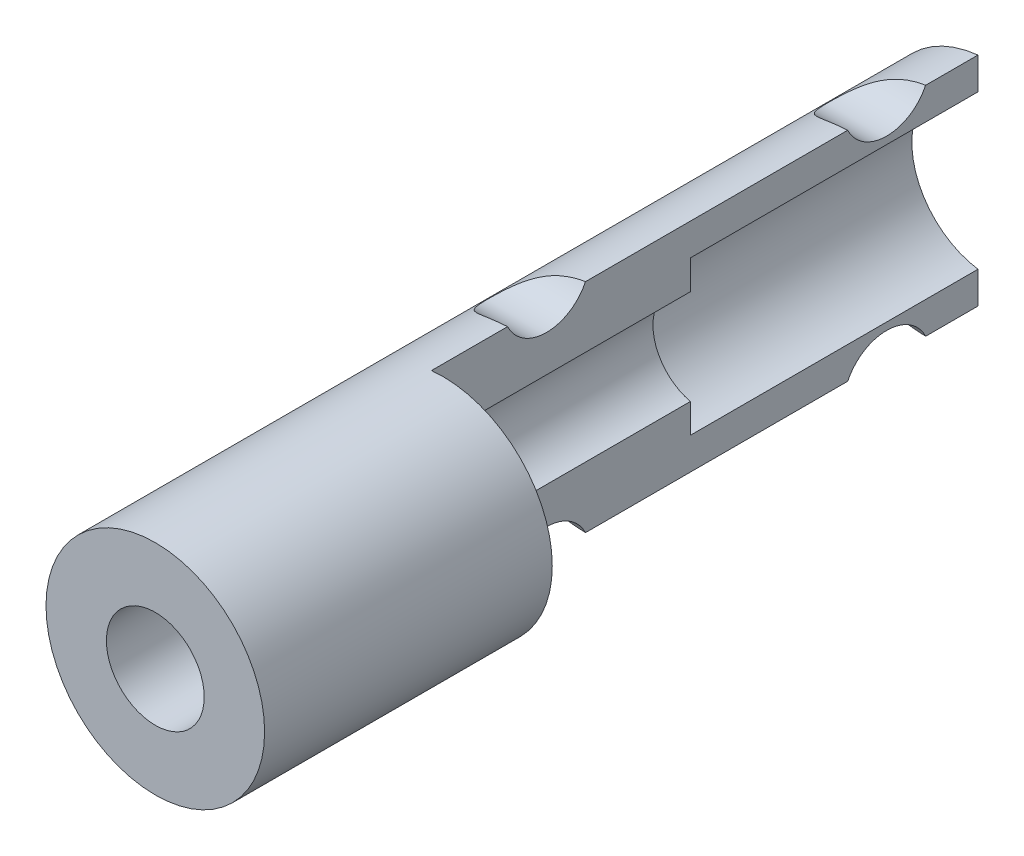
ISO-10303-21;
HEADER;
FILE_DESCRIPTION(('STEP AP214'),'2;1');
FILE_NAME('part.step','',(''),(''),'','','');
FILE_SCHEMA(('AUTOMOTIVE_DESIGN { 1 0 10303 214 1 1 1 1 }'));
ENDSEC;
DATA;
#1=APPLICATION_CONTEXT('core data for automotive mechanical design processes');
#2=APPLICATION_PROTOCOL_DEFINITION('international standard','automotive_design',2000,#1);
#3=PRODUCT_CONTEXT('',#1,'mechanical');
#4=PRODUCT('Part','Part','',(#3));
#5=PRODUCT_RELATED_PRODUCT_CATEGORY('part','',(#4));
#6=PRODUCT_DEFINITION_FORMATION('','',#4);
#7=PRODUCT_DEFINITION_CONTEXT('part definition',#1,'design');
#8=PRODUCT_DEFINITION('design','',#6,#7);
#9=PRODUCT_DEFINITION_SHAPE('','',#8);
#10=(LENGTH_UNIT() NAMED_UNIT(*) SI_UNIT(.MILLI.,.METRE.));
#11=(NAMED_UNIT(*) PLANE_ANGLE_UNIT() SI_UNIT($,.RADIAN.));
#12=(NAMED_UNIT(*) SI_UNIT($,.STERADIAN.) SOLID_ANGLE_UNIT());
#13=UNCERTAINTY_MEASURE_WITH_UNIT(LENGTH_MEASURE(1.E-05),#10,'distance_accuracy_value','');
#14=(GEOMETRIC_REPRESENTATION_CONTEXT(3) GLOBAL_UNCERTAINTY_ASSIGNED_CONTEXT((#13)) GLOBAL_UNIT_ASSIGNED_CONTEXT((#10,
#11,#12)) REPRESENTATION_CONTEXT('',''));
#15=CARTESIAN_POINT('',(0.,0.,0.));
#16=DIRECTION('',(0.,0.,1.));
#17=DIRECTION('',(1.,0.,0.));
#18=AXIS2_PLACEMENT_3D('',#15,#16,#17);
#19=CARTESIAN_POINT('',(0.,0.,-9.));
#20=DIRECTION('',(0.,0.,1.));
#21=DIRECTION('',(1.,0.,0.));
#22=AXIS2_PLACEMENT_3D('',#19,#20,#21);
#23=PLANE('',#22);
#24=CARTESIAN_POINT('',(0.,0.,-9.));
#25=DIRECTION('',(0.,0.,1.));
#26=DIRECTION('',(1.,0.,0.));
#27=AXIS2_PLACEMENT_3D('',#24,#25,#26);
#28=CIRCLE('',#27,2.7);
#29=CARTESIAN_POINT('',(-0.4,2.67020598456374,-9.));
#30=VERTEX_POINT('',#29);
#31=CARTESIAN_POINT('',(-0.4,-2.67020598456374,-9.));
#32=VERTEX_POINT('',#31);
#33=EDGE_CURVE('E35',#30,#32,#28,.T.);
#34=ORIENTED_EDGE('',*,*,#33,.F.);
#35=DIRECTION('',(0.,-1.,0.));
#36=VECTOR('',#35,1.);
#37=CARTESIAN_POINT('',(-0.4,0.,-9.));
#38=LINE('',#37,#36);
#39=CARTESIAN_POINT('',(-0.4,1.65227116418583,-9.));
#40=VERTEX_POINT('',#39);
#41=EDGE_CURVE('E152',#30,#40,#38,.T.);
#42=ORIENTED_EDGE('',*,*,#41,.T.);
#43=CARTESIAN_POINT('',(0.,0.,-9.));
#44=DIRECTION('',(0.,0.,1.));
#45=DIRECTION('',(1.,0.,0.));
#46=AXIS2_PLACEMENT_3D('',#43,#44,#45);
#47=CIRCLE('',#46,1.7);
#48=CARTESIAN_POINT('',(-0.4,-1.65227116418583,-9.));
#49=VERTEX_POINT('',#48);
#50=EDGE_CURVE('E207',#40,#49,#47,.T.);
#51=ORIENTED_EDGE('',*,*,#50,.T.);
#52=EDGE_CURVE('E156',#49,#32,#38,.T.);
#53=ORIENTED_EDGE('',*,*,#52,.T.);
#54=EDGE_LOOP('',(#34,#42,#51,#53));
#55=FACE_BOUND('',#54,.T.);
#56=ADVANCED_FACE('F30',(#55),#23,.F.);
#57=CARTESIAN_POINT('',(0.,0.,0.));
#58=DIRECTION('',(0.,0.,1.));
#59=DIRECTION('',(1.,0.,0.));
#60=AXIS2_PLACEMENT_3D('',#57,#58,#59);
#61=PLANE('',#60);
#62=CARTESIAN_POINT('',(0.,0.,0.));
#63=DIRECTION('',(0.,0.,1.));
#64=DIRECTION('',(1.,0.,0.));
#65=AXIS2_PLACEMENT_3D('',#62,#63,#64);
#66=CIRCLE('',#65,3.8);
#67=CARTESIAN_POINT('',(-0.400000000000001,-3.77888872553824,0.));
#68=VERTEX_POINT('',#67);
#69=CARTESIAN_POINT('',(-0.4,3.77888872553824,0.));
#70=VERTEX_POINT('',#69);
#71=EDGE_CURVE('E110',#68,#70,#66,.T.);
#72=ORIENTED_EDGE('',*,*,#71,.F.);
#73=DIRECTION('',(0.,1.,0.));
#74=VECTOR('',#73,1.);
#75=CARTESIAN_POINT('',(-0.400000000000001,-4.7625,0.));
#76=LINE('',#75,#74);
#77=CARTESIAN_POINT('',(-0.4,-1.65227116418583,0.));
#78=VERTEX_POINT('',#77);
#79=EDGE_CURVE('E112',#68,#78,#76,.T.);
#80=ORIENTED_EDGE('',*,*,#79,.T.);
#81=CARTESIAN_POINT('',(0.,0.,0.));
#82=DIRECTION('',(0.,0.,1.));
#83=DIRECTION('',(1.,0.,0.));
#84=AXIS2_PLACEMENT_3D('',#81,#82,#83);
#85=CIRCLE('',#84,1.7);
#86=CARTESIAN_POINT('',(-0.4,1.65227116418583,0.));
#87=VERTEX_POINT('',#86);
#88=EDGE_CURVE('E212',#78,#87,#85,.T.);
#89=ORIENTED_EDGE('',*,*,#88,.T.);
#90=EDGE_CURVE('E114',#87,#70,#76,.T.);
#91=ORIENTED_EDGE('',*,*,#90,.T.);
#92=EDGE_LOOP('',(#72,#80,#89,#91));
#93=FACE_BOUND('',#92,.T.);
#94=ADVANCED_FACE('F111',(#93),#61,.F.);
#95=CARTESIAN_POINT('',(0.,0.,10.));
#96=DIRECTION('',(0.,0.,1.));
#97=DIRECTION('',(1.,0.,0.));
#98=AXIS2_PLACEMENT_3D('',#95,#96,#97);
#99=PLANE('',#98);
#100=CARTESIAN_POINT('',(0.,0.,10.));
#101=DIRECTION('',(0.,0.,1.));
#102=DIRECTION('',(1.,0.,0.));
#103=AXIS2_PLACEMENT_3D('',#100,#101,#102);
#104=CIRCLE('',#103,3.8);
#105=CARTESIAN_POINT('',(3.8,0.,10.));
#106=VERTEX_POINT('',#105);
#107=EDGE_CURVE('E41',#106,#106,#104,.T.);
#108=ORIENTED_EDGE('',*,*,#107,.T.);
#109=EDGE_LOOP('',(#108));
#110=FACE_BOUND('',#109,.T.);
#111=CARTESIAN_POINT('',(0.,0.,10.));
#112=DIRECTION('',(0.,0.,1.));
#113=DIRECTION('',(1.,0.,0.));
#114=AXIS2_PLACEMENT_3D('',#111,#112,#113);
#115=CIRCLE('',#114,1.7);
#116=CARTESIAN_POINT('',(1.7,0.,10.));
#117=VERTEX_POINT('',#116);
#118=EDGE_CURVE('E118',#117,#117,#115,.T.);
#119=ORIENTED_EDGE('',*,*,#118,.F.);
#120=EDGE_LOOP('',(#119));
#121=FACE_BOUND('',#120,.T.);
#122=ADVANCED_FACE('F254',(#110,#121),#99,.T.);
#123=CARTESIAN_POINT('',(0.,0.,10.));
#124=DIRECTION('',(0.,0.,-1.));
#125=DIRECTION('',(-1.,0.,0.));
#126=AXIS2_PLACEMENT_3D('',#123,#124,#125);
#127=CYLINDRICAL_SURFACE('',#126,3.8);
#128=ORIENTED_EDGE('',*,*,#107,.F.);
#129=EDGE_LOOP('',(#128));
#130=FACE_BOUND('',#129,.T.);
#131=ORIENTED_EDGE('',*,*,#71,.T.);
#132=DIRECTION('',(0.,0.,-1.));
#133=VECTOR('',#132,1.);
#134=CARTESIAN_POINT('',(-0.4,3.77888872553824,10.));
#135=LINE('',#134,#133);
#136=CARTESIAN_POINT('',(-0.400000000000001,3.77888872553824,-2.64628650704317));
#137=VERTEX_POINT('',#136);
#138=EDGE_CURVE('E145',#70,#137,#135,.T.);
#139=ORIENTED_EDGE('',*,*,#138,.T.);
#140=CARTESIAN_POINT('',(0.,3.8,-2.63641098567054));
#141=CARTESIAN_POINT('',(-0.0472110848508148,3.8000002292417,-2.63641415018899));
#142=CARTESIAN_POINT('',(-0.0944170176329823,3.79912003972577,-2.63681388270852));
#143=CARTESIAN_POINT('',(-0.188750732773922,3.79560286668352,-2.63843302414867));
#144=CARTESIAN_POINT('',(-0.235878512620733,3.79296582774583,-2.63965245892288));
#145=CARTESIAN_POINT('',(-0.377168147645948,3.78241589607544,-2.64458462323593));
#146=CARTESIAN_POINT('',(-0.471105704937783,3.77186420364574,-2.64957135359227));
#147=CARTESIAN_POINT('',(-0.658624386903397,3.743700366141,-2.66355646399592));
#148=CARTESIAN_POINT('',(-0.752191626807501,3.72601588157864,-2.6725960555695));
#149=CARTESIAN_POINT('',(-0.937072070197626,3.68386860830173,-2.69566168391102));
#150=CARTESIAN_POINT('',(-1.02838714808378,3.65941167870142,-2.70968341338682));
#151=CARTESIAN_POINT('',(-1.22889192333543,3.59766408218995,-2.7481405915126));
#152=CARTESIAN_POINT('',(-1.33728388703573,3.55871060016659,-2.77424201407262));
#153=CARTESIAN_POINT('',(-1.49410930982097,3.49440113572692,-2.82326910260309));
#154=CARTESIAN_POINT('',(-1.54535168106832,3.47202261098496,-2.84122310106074));
#155=CARTESIAN_POINT('',(-1.64556831376555,3.42566030354076,-2.88095820634447));
#156=CARTESIAN_POINT('',(-1.69454329737437,3.4016770379799,-2.90273808389082));
#157=CARTESIAN_POINT('',(-1.81104789623001,3.34157083026085,-2.96141660647371));
#158=CARTESIAN_POINT('',(-1.87707881744084,3.30481609579804,-3.00072032123821));
#159=CARTESIAN_POINT('',(-2.00131039533952,3.23109219232684,-3.09009671582631));
#160=CARTESIAN_POINT('',(-2.05952143799326,3.19412337714736,-3.14015487764558));
#161=CARTESIAN_POINT('',(-2.15374480835613,3.13111041845086,-3.23941951113693));
#162=CARTESIAN_POINT('',(-2.19180663349201,3.10447730238592,-3.28629280053454));
#163=CARTESIAN_POINT('',(-2.26048188537032,3.05483491127705,-3.38698219375089));
#164=CARTESIAN_POINT('',(-2.29109755615622,3.03182454518604,-3.44079619834975));
#165=CARTESIAN_POINT('',(-2.34384452927909,2.99124046449111,-3.55499330246034));
#166=CARTESIAN_POINT('',(-2.36590210553503,2.97371423366195,-3.61542797223675));
#167=CARTESIAN_POINT('',(-2.40008261836344,2.94620042710955,-3.74067768327662));
#168=CARTESIAN_POINT('',(-2.41221384199314,2.93620656350894,-3.80548902161849));
#169=CARTESIAN_POINT('',(-2.42498887259648,2.92565942929764,-3.92779735332651));
#170=CARTESIAN_POINT('',(-2.42699387615887,2.92398796576131,-3.98506035826235));
#171=CARTESIAN_POINT('',(-2.42312742691518,2.92719339886834,-4.0991227486922));
#172=CARTESIAN_POINT('',(-2.41725882918593,2.93206792184699,-4.15592229473023));
#173=CARTESIAN_POINT('',(-2.39839844904782,2.94751080763081,-4.26432270022253));
#174=CARTESIAN_POINT('',(-2.38580238507302,2.95776233742289,-4.31603935648119));
#175=CARTESIAN_POINT('',(-2.3541927589718,2.98298223272789,-4.41623985587308));
#176=CARTESIAN_POINT('',(-2.33517860113464,2.99795103607729,-4.46472339841669));
#177=CARTESIAN_POINT('',(-2.2899596105223,3.03264584796813,-4.56044763284358));
#178=CARTESIAN_POINT('',(-2.26338175883386,3.05260943571134,-4.60742446541793));
#179=CARTESIAN_POINT('',(-2.20448663857903,3.09541073234929,-4.69614946531641));
#180=CARTESIAN_POINT('',(-2.17216649432203,3.11824987962199,-4.73789499490306));
#181=CARTESIAN_POINT('',(-2.08557462368049,3.17714883623434,-4.83516367848076));
#182=CARTESIAN_POINT('',(-2.02830508060045,3.21420460632225,-4.8874192560233));
#183=CARTESIAN_POINT('',(-1.90545392557712,3.28852867644232,-4.98082565296063));
#184=CARTESIAN_POINT('',(-1.83985570394236,3.32579725499305,-5.02195375330264));
#185=CARTESIAN_POINT('',(-1.72086377426762,3.38849286621819,-5.08492414686839));
#186=CARTESIAN_POINT('',(-1.66887684515012,3.41442864971738,-5.10898505710152));
#187=CARTESIAN_POINT('',(-1.56221967948983,3.46452586724184,-5.1526470317944));
#188=CARTESIAN_POINT('',(-1.50754819881023,3.48868646537169,-5.17224600422673));
#189=CARTESIAN_POINT('',(-1.39585680735143,3.53486245578125,-5.20768602624088));
#190=CARTESIAN_POINT('',(-1.33882830809946,3.55686879550759,-5.2235115880139));
#191=CARTESIAN_POINT('',(-1.22304796730055,3.59832442003112,-5.25189342178555));
#192=CARTESIAN_POINT('',(-1.16429561421141,3.61777293623025,-5.2644487122095));
#193=CARTESIAN_POINT('',(-1.01598376938573,3.66283982156107,-5.29233428442022));
#194=CARTESIAN_POINT('',(-0.925576817816896,3.68674389290041,-5.30595961159954));
#195=CARTESIAN_POINT('',(-0.742637643959554,3.72790785436573,-5.32838573244113));
#196=CARTESIAN_POINT('',(-0.650103851941343,3.7451626584422,-5.33718283514966));
#197=CARTESIAN_POINT('',(-0.46485844798207,3.77260698869726,-5.35078336731414));
#198=CARTESIAN_POINT('',(-0.372162756164548,3.78288008299986,-5.35563417606231));
#199=CARTESIAN_POINT('',(-0.232749209916213,3.79315149504083,-5.36043350211836));
#200=CARTESIAN_POINT('',(-0.186245645815491,3.79571892451193,-5.36162049329082));
#201=CARTESIAN_POINT('',(-0.0931631572411818,3.79914320200506,-5.36319673338576));
#202=CARTESIAN_POINT('',(-0.0465842346465047,3.8000000920376,-5.36358600190014));
#203=CARTESIAN_POINT('',(0.,3.8,-5.36358901432946));
#204=B_SPLINE_CURVE_WITH_KNOTS('',3,(#140,#141,#142,#143,#144,#145,#146,#147,#148,#149,#150,
#151,#152,#153,#154,#155,#156,#157,#158,#159,#160,#161,#162,#163,#164,#165,#166,#167,#168,#169,
#170,#171,#172,#173,#174,#175,#176,#177,#178,#179,#180,#181,#182,#183,#184,#185,#186,#187,#188,
#189,#190,#191,#192,#193,#194,#195,#196,#197,#198,#199,#200,#201,#202,#203),.UNSPECIFIED.,.F.,
.F.,(4,2,2,2,2,2,2,2,2,2,2,2,2,2,2,2,2,2,2,2,2,2,2,2,2,2,2,2,2,2,2,4),(0.,0.141612905181507,
0.283230277073251,0.566855595713618,0.853432775709184,1.1397627967211,1.4928670227825,
1.66889342531344,1.84486337252923,2.09954048829289,2.35387593817474,2.55109611220349,
2.74825677624256,2.9470800995237,3.14573726447139,3.31680964490994,3.48782000889844,
3.64972918995618,3.81165340313614,3.98362655197085,4.15568606748177,4.41202627050524,
4.66888596195224,4.85728861267621,5.04577941691321,5.23503104602294,5.42433941388004,
5.70739884796124,5.99067436752892,6.27049648638923,6.4102323510813,6.54996478384521),.UNSPECIFIED.);
#205=CARTESIAN_POINT('',(-0.4,3.77888872553824,-5.35371349295683));
#206=VERTEX_POINT('',#205);
#207=EDGE_CURVE('E196',#137,#206,#204,.T.);
#208=ORIENTED_EDGE('',*,*,#207,.T.);
#209=CARTESIAN_POINT('',(-0.400000000000001,3.77888872553824,-14.4712865070432));
#210=VERTEX_POINT('',#209);
#211=EDGE_CURVE('E144',#206,#210,#135,.T.);
#212=ORIENTED_EDGE('',*,*,#211,.T.);
#213=CARTESIAN_POINT('',(0.,3.8,-14.4614109856705));
#214=CARTESIAN_POINT('',(-0.0472110848508147,3.8000002292417,-14.461414150189));
#215=CARTESIAN_POINT('',(-0.0944170176329822,3.79912003972577,-14.4618138827085));
#216=CARTESIAN_POINT('',(-0.188750732773921,3.79560286668352,-14.4634330241487));
#217=CARTESIAN_POINT('',(-0.235878512620733,3.79296582774583,-14.4646524589229));
#218=CARTESIAN_POINT('',(-0.377168147645948,3.78241589607544,-14.4695846232359));
#219=CARTESIAN_POINT('',(-0.471105704937783,3.77186420364574,-14.4745713535923));
#220=CARTESIAN_POINT('',(-0.658624386903397,3.743700366141,-14.4885564639959));
#221=CARTESIAN_POINT('',(-0.752191626807501,3.72601588157864,-14.4975960555695));
#222=CARTESIAN_POINT('',(-0.937072070197626,3.68386860830173,-14.520661683911));
#223=CARTESIAN_POINT('',(-1.02838714808378,3.65941167870142,-14.5346834133868));
#224=CARTESIAN_POINT('',(-1.22889192333543,3.59766408218995,-14.5731405915126));
#225=CARTESIAN_POINT('',(-1.33728388703573,3.55871060016659,-14.5992420140726));
#226=CARTESIAN_POINT('',(-1.49410930982097,3.49440113572692,-14.6482691026031));
#227=CARTESIAN_POINT('',(-1.54535168106832,3.47202261098496,-14.6662231010607));
#228=CARTESIAN_POINT('',(-1.64556831376555,3.42566030354076,-14.7059582063445));
#229=CARTESIAN_POINT('',(-1.69454329737437,3.4016770379799,-14.7277380838908));
#230=CARTESIAN_POINT('',(-1.81104789623001,3.34157083026085,-14.7864166064737));
#231=CARTESIAN_POINT('',(-1.87707881744084,3.30481609579804,-14.8257203212382));
#232=CARTESIAN_POINT('',(-2.00131039533952,3.23109219232684,-14.9150967158263));
#233=CARTESIAN_POINT('',(-2.05952143799326,3.19412337714736,-14.9651548776456));
#234=CARTESIAN_POINT('',(-2.15374480835613,3.13111041845086,-15.0644195111369));
#235=CARTESIAN_POINT('',(-2.19180663349201,3.10447730238592,-15.1112928005345));
#236=CARTESIAN_POINT('',(-2.26048188537033,3.05483491127705,-15.2119821937509));
#237=CARTESIAN_POINT('',(-2.29109755615622,3.03182454518604,-15.2657961983498));
#238=CARTESIAN_POINT('',(-2.34384452927909,2.99124046449111,-15.3799933024603));
#239=CARTESIAN_POINT('',(-2.36590210553503,2.97371423366195,-15.4404279722367));
#240=CARTESIAN_POINT('',(-2.40008261836344,2.94620042710955,-15.5656776832766));
#241=CARTESIAN_POINT('',(-2.41221384199314,2.93620656350894,-15.6304890216185));
#242=CARTESIAN_POINT('',(-2.42498887259649,2.92565942929764,-15.7527973533265));
#243=CARTESIAN_POINT('',(-2.42699387615887,2.92398796576131,-15.8100603582623));
#244=CARTESIAN_POINT('',(-2.42312742691519,2.92719339886834,-15.9241227486922));
#245=CARTESIAN_POINT('',(-2.41725882918593,2.93206792184699,-15.9809222947302));
#246=CARTESIAN_POINT('',(-2.39839844904782,2.9475108076308,-16.0893227002225));
#247=CARTESIAN_POINT('',(-2.38580238507302,2.95776233742288,-16.1410393564812));
#248=CARTESIAN_POINT('',(-2.3541927589718,2.98298223272789,-16.2412398558731));
#249=CARTESIAN_POINT('',(-2.33517860113465,2.99795103607729,-16.2897233984167));
#250=CARTESIAN_POINT('',(-2.2899596105223,3.03264584796813,-16.3854476328436));
#251=CARTESIAN_POINT('',(-2.26338175883387,3.05260943571134,-16.4324244654179));
#252=CARTESIAN_POINT('',(-2.20448663857903,3.09541073234929,-16.5211494653164));
#253=CARTESIAN_POINT('',(-2.17216649432204,3.11824987962199,-16.5628949949031));
#254=CARTESIAN_POINT('',(-2.08557462368049,3.17714883623434,-16.6601636784808));
#255=CARTESIAN_POINT('',(-2.02830508060045,3.21420460632225,-16.7124192560233));
#256=CARTESIAN_POINT('',(-1.90545392557713,3.28852867644232,-16.8058256529606));
#257=CARTESIAN_POINT('',(-1.83985570394237,3.32579725499304,-16.8469537533026));
#258=CARTESIAN_POINT('',(-1.72086377426763,3.38849286621819,-16.9099241468684));
#259=CARTESIAN_POINT('',(-1.66887684515013,3.41442864971738,-16.9339850571015));
#260=CARTESIAN_POINT('',(-1.56221967948984,3.46452586724184,-16.9776470317944));
#261=CARTESIAN_POINT('',(-1.50754819881024,3.48868646537168,-16.9972460042267));
#262=CARTESIAN_POINT('',(-1.39585680735144,3.53486245578125,-17.0326860262409));
#263=CARTESIAN_POINT('',(-1.33882830809948,3.55686879550759,-17.0485115880139));
#264=CARTESIAN_POINT('',(-1.22304796730056,3.59832442003112,-17.0768934217855));
#265=CARTESIAN_POINT('',(-1.16429561421143,3.61777293623025,-17.0894487122095));
#266=CARTESIAN_POINT('',(-1.01598376938574,3.66283982156106,-17.1173342844202));
#267=CARTESIAN_POINT('',(-0.925576817816907,3.6867438929004,-17.1309596115995));
#268=CARTESIAN_POINT('',(-0.742637643959562,3.72790785436573,-17.1533857324411));
#269=CARTESIAN_POINT('',(-0.65010385194135,3.7451626584422,-17.1621828351497));
#270=CARTESIAN_POINT('',(-0.464858447982075,3.77260698869726,-17.1757833673141));
#271=CARTESIAN_POINT('',(-0.372162756164552,3.78288008299986,-17.1806341760623));
#272=CARTESIAN_POINT('',(-0.232749209916216,3.79315149504083,-17.1854335021184));
#273=CARTESIAN_POINT('',(-0.186245645815493,3.79571892451193,-17.1866204932908));
#274=CARTESIAN_POINT('',(-0.0931631572411827,3.79914320200506,-17.1881967333858));
#275=CARTESIAN_POINT('',(-0.0465842346465051,3.8000000920376,-17.1885860019001));
#276=CARTESIAN_POINT('',(0.,3.8,-17.1885890143295));
#277=B_SPLINE_CURVE_WITH_KNOTS('',3,(#213,#214,#215,#216,#217,#218,#219,#220,#221,#222,#223,
#224,#225,#226,#227,#228,#229,#230,#231,#232,#233,#234,#235,#236,#237,#238,#239,#240,#241,#242,
#243,#244,#245,#246,#247,#248,#249,#250,#251,#252,#253,#254,#255,#256,#257,#258,#259,#260,#261,
#262,#263,#264,#265,#266,#267,#268,#269,#270,#271,#272,#273,#274,#275,#276),.UNSPECIFIED.,.F.,
.F.,(4,2,2,2,2,2,2,2,2,2,2,2,2,2,2,2,2,2,2,2,2,2,2,2,2,2,2,2,2,2,2,4),(0.,0.141612905181507,
0.283230277073251,0.566855595713618,0.853432775709184,1.1397627967211,1.4928670227825,
1.66889342531344,1.84486337252923,2.09954048829289,2.35387593817474,2.55109611220349,
2.74825677624256,2.9470800995237,3.14573726447139,3.31680964490995,3.48782000889844,
3.64972918995618,3.81165340313614,3.98362655197085,4.15568606748177,4.41202627050524,
4.66888596195224,4.8572886126762,5.0457794169132,5.23503104602293,5.42433941388003,
5.70739884796124,5.99067436752892,6.27049648638923,6.4102323510813,6.54996478384522),.UNSPECIFIED.);
#278=CARTESIAN_POINT('',(-0.400000000000001,3.77888872553824,-17.1787134929568));
#279=VERTEX_POINT('',#278);
#280=EDGE_CURVE('E190',#210,#279,#277,.T.);
#281=ORIENTED_EDGE('',*,*,#280,.T.);
#282=CARTESIAN_POINT('',(-0.4,3.77888872553824,-19.));
#283=VERTEX_POINT('',#282);
#284=EDGE_CURVE('E48',#279,#283,#135,.T.);
#285=ORIENTED_EDGE('',*,*,#284,.T.);
#286=CARTESIAN_POINT('',(0.,0.,-19.));
#287=DIRECTION('',(0.,0.,-1.));
#288=DIRECTION('',(1.,0.,0.));
#289=AXIS2_PLACEMENT_3D('',#286,#287,#288);
#290=CIRCLE('',#289,3.8);
#291=CARTESIAN_POINT('',(-0.400000000000001,-3.77888872553824,-19.));
#292=VERTEX_POINT('',#291);
#293=EDGE_CURVE('E202',#292,#283,#290,.T.);
#294=ORIENTED_EDGE('',*,*,#293,.F.);
#295=DIRECTION('',(0.,0.,-1.));
#296=VECTOR('',#295,1.);
#297=CARTESIAN_POINT('',(-0.400000000000001,-3.77888872553824,10.));
#298=LINE('',#297,#296);
#299=CARTESIAN_POINT('',(-0.400000000000001,-3.77888872553824,-17.1787134929568));
#300=VERTEX_POINT('',#299);
#301=EDGE_CURVE('E131',#292,#300,#298,.F.);
#302=ORIENTED_EDGE('',*,*,#301,.T.);
#303=CARTESIAN_POINT('',(0.,-3.8,-17.1885890143295));
#304=CARTESIAN_POINT('',(-0.0472110848508147,-3.8000002292417,-17.188585849811));
#305=CARTESIAN_POINT('',(-0.0944170176329822,-3.79912003972577,-17.1881861172915));
#306=CARTESIAN_POINT('',(-0.188750732773922,-3.79560286668352,-17.1865669758513));
#307=CARTESIAN_POINT('',(-0.235878512620733,-3.79296582774583,-17.1853475410771));
#308=CARTESIAN_POINT('',(-0.377168147645948,-3.78241589607543,-17.1804153767641));
#309=CARTESIAN_POINT('',(-0.471105704937784,-3.77186420364574,-17.1754286464077));
#310=CARTESIAN_POINT('',(-0.658624386903397,-3.743700366141,-17.1614435360041));
#311=CARTESIAN_POINT('',(-0.752191626807501,-3.72601588157864,-17.1524039444305));
#312=CARTESIAN_POINT('',(-0.937072070197627,-3.68386860830173,-17.129338316089));
#313=CARTESIAN_POINT('',(-1.02838714808379,-3.65941167870142,-17.1153165866132));
#314=CARTESIAN_POINT('',(-1.22889192333543,-3.59766408218995,-17.0768594084874));
#315=CARTESIAN_POINT('',(-1.33728388703573,-3.55871060016659,-17.0507579859274));
#316=CARTESIAN_POINT('',(-1.49410930982097,-3.49440113572691,-17.0017308973969));
#317=CARTESIAN_POINT('',(-1.54535168106832,-3.47202261098496,-16.9837768989393));
#318=CARTESIAN_POINT('',(-1.64556831376555,-3.42566030354076,-16.9440417936555));
#319=CARTESIAN_POINT('',(-1.69454329737437,-3.4016770379799,-16.9222619161092));
#320=CARTESIAN_POINT('',(-1.81104789623001,-3.34157083026085,-16.8635833935263));
#321=CARTESIAN_POINT('',(-1.87707881744085,-3.30481609579804,-16.8242796787618));
#322=CARTESIAN_POINT('',(-2.00131039533952,-3.23109219232684,-16.7349032841737));
#323=CARTESIAN_POINT('',(-2.05952143799326,-3.19412337714736,-16.6848451223544));
#324=CARTESIAN_POINT('',(-2.15374480835613,-3.13111041845086,-16.5855804888631));
#325=CARTESIAN_POINT('',(-2.19180663349201,-3.10447730238592,-16.5387071994655));
#326=CARTESIAN_POINT('',(-2.26048188537033,-3.05483491127705,-16.4380178062491));
#327=CARTESIAN_POINT('',(-2.29109755615623,-3.03182454518604,-16.3842038016502));
#328=CARTESIAN_POINT('',(-2.34384452927909,-2.99124046449111,-16.2700066975397));
#329=CARTESIAN_POINT('',(-2.36590210553504,-2.97371423366195,-16.2095720277632));
#330=CARTESIAN_POINT('',(-2.40008261836345,-2.94620042710955,-16.0843223167234));
#331=CARTESIAN_POINT('',(-2.41221384199315,-2.93620656350894,-16.0195109783815));
#332=CARTESIAN_POINT('',(-2.42498887259649,-2.92565942929764,-15.8972026466735));
#333=CARTESIAN_POINT('',(-2.42699387615887,-2.92398796576131,-15.8399396417376));
#334=CARTESIAN_POINT('',(-2.42312742691519,-2.92719339886834,-15.7258772513078));
#335=CARTESIAN_POINT('',(-2.41725882918593,-2.93206792184699,-15.6690777052698));
#336=CARTESIAN_POINT('',(-2.39839844904782,-2.9475108076308,-15.5606772997775));
#337=CARTESIAN_POINT('',(-2.38580238507302,-2.95776233742288,-15.5089606435188));
#338=CARTESIAN_POINT('',(-2.3541927589718,-2.98298223272789,-15.4087601441269));
#339=CARTESIAN_POINT('',(-2.33517860113465,-2.99795103607729,-15.3602766015833));
#340=CARTESIAN_POINT('',(-2.2899596105223,-3.03264584796813,-15.2645523671564));
#341=CARTESIAN_POINT('',(-2.26338175883387,-3.05260943571134,-15.2175755345821));
#342=CARTESIAN_POINT('',(-2.20448663857903,-3.09541073234929,-15.1288505346836));
#343=CARTESIAN_POINT('',(-2.17216649432203,-3.11824987962199,-15.0871050050969));
#344=CARTESIAN_POINT('',(-2.08557462368049,-3.17714883623434,-14.9898363215192));
#345=CARTESIAN_POINT('',(-2.02830508060045,-3.21420460632225,-14.9375807439767));
#346=CARTESIAN_POINT('',(-1.90545392557712,-3.28852867644232,-14.8441743470394));
#347=CARTESIAN_POINT('',(-1.83985570394236,-3.32579725499305,-14.8030462466974));
#348=CARTESIAN_POINT('',(-1.72086377426762,-3.38849286621819,-14.7400758531316));
#349=CARTESIAN_POINT('',(-1.66887684515012,-3.41442864971738,-14.7160149428985));
#350=CARTESIAN_POINT('',(-1.56221967948983,-3.46452586724184,-14.6723529682056));
#351=CARTESIAN_POINT('',(-1.50754819881023,-3.48868646537169,-14.6527539957733));
#352=CARTESIAN_POINT('',(-1.39585680735143,-3.53486245578125,-14.6173139737591));
#353=CARTESIAN_POINT('',(-1.33882830809946,-3.55686879550759,-14.6014884119861));
#354=CARTESIAN_POINT('',(-1.22304796730055,-3.59832442003112,-14.5731065782144));
#355=CARTESIAN_POINT('',(-1.16429561421141,-3.61777293623025,-14.5605512877905));
#356=CARTESIAN_POINT('',(-1.01598376938573,-3.66283982156107,-14.5326657155798));
#357=CARTESIAN_POINT('',(-0.925576817816893,-3.68674389290041,-14.5190403884005));
#358=CARTESIAN_POINT('',(-0.742637643959552,-3.72790785436573,-14.4966142675589));
#359=CARTESIAN_POINT('',(-0.650103851941341,-3.7451626584422,-14.4878171648503));
#360=CARTESIAN_POINT('',(-0.464858447982068,-3.77260698869726,-14.4742166326859));
#361=CARTESIAN_POINT('',(-0.372162756164546,-3.78288008299986,-14.4693658239377));
#362=CARTESIAN_POINT('',(-0.232749209916213,-3.79315149504083,-14.4645664978816));
#363=CARTESIAN_POINT('',(-0.186245645815491,-3.79571892451193,-14.4633795067092));
#364=CARTESIAN_POINT('',(-0.0931631572411817,-3.79914320200506,-14.4618032666142));
#365=CARTESIAN_POINT('',(-0.0465842346465045,-3.8000000920376,-14.4614139980999));
#366=CARTESIAN_POINT('',(0.,-3.8,-14.4614109856705));
#367=B_SPLINE_CURVE_WITH_KNOTS('',3,(#303,#304,#305,#306,#307,#308,#309,#310,#311,#312,#313,
#314,#315,#316,#317,#318,#319,#320,#321,#322,#323,#324,#325,#326,#327,#328,#329,#330,#331,#332,
#333,#334,#335,#336,#337,#338,#339,#340,#341,#342,#343,#344,#345,#346,#347,#348,#349,#350,#351,
#352,#353,#354,#355,#356,#357,#358,#359,#360,#361,#362,#363,#364,#365,#366),.UNSPECIFIED.,.F.,
.F.,(4,2,2,2,2,2,2,2,2,2,2,2,2,2,2,2,2,2,2,2,2,2,2,2,2,2,2,2,2,2,2,4),(0.,0.141612905181507,
0.283230277073251,0.566855595713618,0.853432775709185,1.1397627967211,1.4928670227825,
1.66889342531344,1.84486337252923,2.09954048829289,2.35387593817474,2.5510961122035,
2.74825677624257,2.94708009952371,3.1457372644714,3.31680964490995,3.48782000889845,
3.64972918995619,3.81165340313615,3.98362655197086,4.15568606748178,4.41202627050526,
4.66888596195225,4.85728861267622,5.04577941691322,5.23503104602295,5.42433941388005,
5.70739884796126,5.99067436752893,6.27049648638924,6.41023235108131,6.54996478384522),.UNSPECIFIED.);
#368=CARTESIAN_POINT('',(-0.400000000000001,-3.77888872553824,-14.4712865070432));
#369=VERTEX_POINT('',#368);
#370=EDGE_CURVE('E167',#300,#369,#367,.T.);
#371=ORIENTED_EDGE('',*,*,#370,.T.);
#372=CARTESIAN_POINT('',(-0.400000000000001,-3.77888872553824,-5.35371349295684));
#373=VERTEX_POINT('',#372);
#374=EDGE_CURVE('E129',#369,#373,#298,.F.);
#375=ORIENTED_EDGE('',*,*,#374,.T.);
#376=CARTESIAN_POINT('',(0.,-3.8,-5.36358901432946));
#377=CARTESIAN_POINT('',(-0.0472110848508149,-3.8000002292417,-5.36358584981101));
#378=CARTESIAN_POINT('',(-0.0944170176329824,-3.79912003972577,-5.36318611729148));
#379=CARTESIAN_POINT('',(-0.188750732773922,-3.79560286668352,-5.36156697585133));
#380=CARTESIAN_POINT('',(-0.235878512620733,-3.79296582774583,-5.36034754107712));
#381=CARTESIAN_POINT('',(-0.377168147645948,-3.78241589607543,-5.35541537676407));
#382=CARTESIAN_POINT('',(-0.471105704937784,-3.77186420364574,-5.35042864640773));
#383=CARTESIAN_POINT('',(-0.658624386903397,-3.743700366141,-5.33644353600408));
#384=CARTESIAN_POINT('',(-0.752191626807501,-3.72601588157864,-5.3274039444305));
#385=CARTESIAN_POINT('',(-0.937072070197627,-3.68386860830173,-5.30433831608898));
#386=CARTESIAN_POINT('',(-1.02838714808378,-3.65941167870142,-5.29031658661318));
#387=CARTESIAN_POINT('',(-1.22889192333543,-3.59766408218995,-5.2518594084874));
#388=CARTESIAN_POINT('',(-1.33728388703573,-3.55871060016659,-5.22575798592738));
#389=CARTESIAN_POINT('',(-1.49410930982097,-3.49440113572692,-5.17673089739691));
#390=CARTESIAN_POINT('',(-1.54535168106832,-3.47202261098496,-5.15877689893926));
#391=CARTESIAN_POINT('',(-1.64556831376555,-3.42566030354076,-5.11904179365553));
#392=CARTESIAN_POINT('',(-1.69454329737437,-3.4016770379799,-5.09726191610918));
#393=CARTESIAN_POINT('',(-1.81104789623001,-3.34157083026085,-5.03858339352629));
#394=CARTESIAN_POINT('',(-1.87707881744085,-3.30481609579804,-4.99927967876179));
#395=CARTESIAN_POINT('',(-2.00131039533952,-3.23109219232684,-4.90990328417369));
#396=CARTESIAN_POINT('',(-2.05952143799326,-3.19412337714736,-4.85984512235442));
#397=CARTESIAN_POINT('',(-2.15374480835613,-3.13111041845086,-4.76058048886307));
#398=CARTESIAN_POINT('',(-2.19180663349201,-3.10447730238591,-4.71370719946546));
#399=CARTESIAN_POINT('',(-2.26048188537033,-3.05483491127705,-4.61301780624911));
#400=CARTESIAN_POINT('',(-2.29109755615622,-3.03182454518604,-4.55920380165025));
#401=CARTESIAN_POINT('',(-2.34384452927909,-2.99124046449111,-4.44500669753966));
#402=CARTESIAN_POINT('',(-2.36590210553503,-2.97371423366195,-4.38457202776325));
#403=CARTESIAN_POINT('',(-2.40008261836344,-2.94620042710955,-4.25932231672338));
#404=CARTESIAN_POINT('',(-2.41221384199314,-2.93620656350894,-4.19451097838151));
#405=CARTESIAN_POINT('',(-2.42498887259649,-2.92565942929764,-4.07220264667349));
#406=CARTESIAN_POINT('',(-2.42699387615887,-2.92398796576131,-4.01493964173765));
#407=CARTESIAN_POINT('',(-2.42312742691519,-2.92719339886834,-3.90087725130781));
#408=CARTESIAN_POINT('',(-2.41725882918593,-2.93206792184699,-3.84407770526977));
#409=CARTESIAN_POINT('',(-2.39839844904782,-2.9475108076308,-3.73567729977747));
#410=CARTESIAN_POINT('',(-2.38580238507302,-2.95776233742288,-3.68396064351881));
#411=CARTESIAN_POINT('',(-2.3541927589718,-2.98298223272789,-3.58376014412693));
#412=CARTESIAN_POINT('',(-2.33517860113465,-2.99795103607729,-3.53527660158332));
#413=CARTESIAN_POINT('',(-2.2899596105223,-3.03264584796813,-3.43955236715642));
#414=CARTESIAN_POINT('',(-2.26338175883387,-3.05260943571134,-3.39257553458207));
#415=CARTESIAN_POINT('',(-2.20448663857903,-3.09541073234929,-3.30385053468359));
#416=CARTESIAN_POINT('',(-2.17216649432204,-3.11824987962199,-3.26210500509694));
#417=CARTESIAN_POINT('',(-2.08557462368049,-3.17714883623434,-3.16483632151924));
#418=CARTESIAN_POINT('',(-2.02830508060045,-3.21420460632225,-3.1125807439767));
#419=CARTESIAN_POINT('',(-1.90545392557712,-3.28852867644232,-3.01917434703937));
#420=CARTESIAN_POINT('',(-1.83985570394237,-3.32579725499305,-2.97804624669736));
#421=CARTESIAN_POINT('',(-1.72086377426762,-3.38849286621819,-2.91507585313161));
#422=CARTESIAN_POINT('',(-1.66887684515012,-3.41442864971738,-2.89101494289848));
#423=CARTESIAN_POINT('',(-1.56221967948983,-3.46452586724184,-2.8473529682056));
#424=CARTESIAN_POINT('',(-1.50754819881023,-3.48868646537169,-2.82775399577327));
#425=CARTESIAN_POINT('',(-1.39585680735143,-3.53486245578125,-2.79231397375912));
#426=CARTESIAN_POINT('',(-1.33882830809947,-3.55686879550759,-2.7764884119861));
#427=CARTESIAN_POINT('',(-1.22304796730056,-3.59832442003112,-2.74810657821445));
#428=CARTESIAN_POINT('',(-1.16429561421142,-3.61777293623025,-2.7355512877905));
#429=CARTESIAN_POINT('',(-1.01598376938573,-3.66283982156107,-2.70766571557978));
#430=CARTESIAN_POINT('',(-0.925576817816899,-3.68674389290041,-2.69404038840046));
#431=CARTESIAN_POINT('',(-0.742637643959557,-3.72790785436573,-2.67161426755887));
#432=CARTESIAN_POINT('',(-0.650103851941345,-3.7451626584422,-2.66281716485034));
#433=CARTESIAN_POINT('',(-0.464858447982071,-3.77260698869726,-2.64921663268586));
#434=CARTESIAN_POINT('',(-0.372162756164549,-3.78288008299986,-2.64436582393769));
#435=CARTESIAN_POINT('',(-0.232749209916214,-3.79315149504083,-2.63956649788164));
#436=CARTESIAN_POINT('',(-0.186245645815491,-3.79571892451193,-2.63837950670918));
#437=CARTESIAN_POINT('',(-0.0931631572411816,-3.79914320200506,-2.63680326661425));
#438=CARTESIAN_POINT('',(-0.0465842346465045,-3.8000000920376,-2.63641399809986));
#439=CARTESIAN_POINT('',(0.,-3.8,-2.63641098567054));
#440=B_SPLINE_CURVE_WITH_KNOTS('',3,(#376,#377,#378,#379,#380,#381,#382,#383,#384,#385,#386,
#387,#388,#389,#390,#391,#392,#393,#394,#395,#396,#397,#398,#399,#400,#401,#402,#403,#404,#405,
#406,#407,#408,#409,#410,#411,#412,#413,#414,#415,#416,#417,#418,#419,#420,#421,#422,#423,#424,
#425,#426,#427,#428,#429,#430,#431,#432,#433,#434,#435,#436,#437,#438,#439),.UNSPECIFIED.,.F.,
.F.,(4,2,2,2,2,2,2,2,2,2,2,2,2,2,2,2,2,2,2,2,2,2,2,2,2,2,2,2,2,2,2,4),(0.,0.141612905181507,
0.283230277073251,0.566855595713618,0.853432775709185,1.1397627967211,1.4928670227825,
1.66889342531344,1.84486337252923,2.09954048829289,2.35387593817474,2.5510961122035,
2.74825677624256,2.9470800995237,3.14573726447139,3.31680964490995,3.48782000889844,
3.64972918995618,3.81165340313614,3.98362655197085,4.15568606748177,4.41202627050525,
4.66888596195224,4.85728861267621,5.04577941691321,5.23503104602294,5.42433941388004,
5.70739884796124,5.99067436752892,6.27049648638924,6.4102323510813,6.54996478384522),.UNSPECIFIED.);
#441=CARTESIAN_POINT('',(-0.400000000000001,-3.77888872553824,-2.64628650704316));
#442=VERTEX_POINT('',#441);
#443=EDGE_CURVE('E128',#373,#442,#440,.T.);
#444=ORIENTED_EDGE('',*,*,#443,.T.);
#445=EDGE_CURVE('E56',#442,#68,#298,.F.);
#446=ORIENTED_EDGE('',*,*,#445,.T.);
#447=EDGE_LOOP('',(#131,#139,#208,#212,#281,#285,#294,#302,#371,#375,#444,#446));
#448=FACE_BOUND('',#447,.T.);
#449=ADVANCED_FACE('F32',(#130,#448),#127,.T.);
#450=CARTESIAN_POINT('',(0.,0.,10.));
#451=DIRECTION('',(0.,0.,-1.));
#452=DIRECTION('',(-1.,0.,0.));
#453=AXIS2_PLACEMENT_3D('',#450,#451,#452);
#454=CYLINDRICAL_SURFACE('',#453,1.7);
#455=DIRECTION('',(0.,0.,-1.));
#456=VECTOR('',#455,1.);
#457=CARTESIAN_POINT('',(-0.4,1.65227116418583,10.));
#458=LINE('',#457,#456);
#459=EDGE_CURVE('E155',#87,#40,#458,.T.);
#460=ORIENTED_EDGE('',*,*,#459,.F.);
#461=ORIENTED_EDGE('',*,*,#88,.F.);
#462=DIRECTION('',(0.,0.,-1.));
#463=VECTOR('',#462,1.);
#464=CARTESIAN_POINT('',(-0.4,-1.65227116418583,10.));
#465=LINE('',#464,#463);
#466=EDGE_CURVE('E123',#49,#78,#465,.F.);
#467=ORIENTED_EDGE('',*,*,#466,.F.);
#468=ORIENTED_EDGE('',*,*,#50,.F.);
#469=EDGE_LOOP('',(#460,#461,#467,#468));
#470=FACE_BOUND('',#469,.T.);
#471=ORIENTED_EDGE('',*,*,#118,.T.);
#472=EDGE_LOOP('',(#471));
#473=FACE_BOUND('',#472,.T.);
#474=ADVANCED_FACE('F226',(#470,#473),#454,.F.);
#475=CARTESIAN_POINT('',(0.,0.,-19.));
#476=DIRECTION('',(0.,0.,1.));
#477=DIRECTION('',(1.,0.,0.));
#478=AXIS2_PLACEMENT_3D('',#475,#476,#477);
#479=CYLINDRICAL_SURFACE('',#478,2.7);
#480=ORIENTED_EDGE('',*,*,#33,.T.);
#481=DIRECTION('',(0.,0.,1.));
#482=VECTOR('',#481,1.);
#483=CARTESIAN_POINT('',(-0.4,-2.67020598456374,-19.));
#484=LINE('',#483,#482);
#485=CARTESIAN_POINT('',(-0.4,-2.67020598456374,-19.));
#486=VERTEX_POINT('',#485);
#487=EDGE_CURVE('E158',#32,#486,#484,.F.);
#488=ORIENTED_EDGE('',*,*,#487,.T.);
#489=CARTESIAN_POINT('',(0.,0.,-19.));
#490=DIRECTION('',(0.,0.,1.));
#491=DIRECTION('',(1.,0.,0.));
#492=AXIS2_PLACEMENT_3D('',#489,#490,#491);
#493=CIRCLE('',#492,2.7);
#494=CARTESIAN_POINT('',(-0.4,2.67020598456374,-19.));
#495=VERTEX_POINT('',#494);
#496=EDGE_CURVE('E205',#495,#486,#493,.T.);
#497=ORIENTED_EDGE('',*,*,#496,.F.);
#498=DIRECTION('',(0.,0.,1.));
#499=VECTOR('',#498,1.);
#500=CARTESIAN_POINT('',(-0.4,2.67020598456374,-19.));
#501=LINE('',#500,#499);
#502=EDGE_CURVE('E149',#495,#30,#501,.T.);
#503=ORIENTED_EDGE('',*,*,#502,.T.);
#504=EDGE_LOOP('',(#480,#488,#497,#503));
#505=FACE_BOUND('',#504,.T.);
#506=ADVANCED_FACE('F235',(#505),#479,.F.);
#507=CARTESIAN_POINT('',(0.,0.,-19.));
#508=DIRECTION('',(0.,0.,1.));
#509=DIRECTION('',(1.,0.,0.));
#510=AXIS2_PLACEMENT_3D('',#507,#508,#509);
#511=PLANE('',#510);
#512=ORIENTED_EDGE('',*,*,#293,.T.);
#513=DIRECTION('',(0.,1.,0.));
#514=VECTOR('',#513,1.);
#515=CARTESIAN_POINT('',(-0.400000000000001,-4.7625,-19.));
#516=LINE('',#515,#514);
#517=EDGE_CURVE('E239',#495,#283,#516,.T.);
#518=ORIENTED_EDGE('',*,*,#517,.F.);
#519=ORIENTED_EDGE('',*,*,#496,.T.);
#520=EDGE_CURVE('E224',#292,#486,#516,.T.);
#521=ORIENTED_EDGE('',*,*,#520,.F.);
#522=EDGE_LOOP('',(#512,#518,#519,#521));
#523=FACE_BOUND('',#522,.T.);
#524=ADVANCED_FACE('F238',(#523),#511,.F.);
#525=CARTESIAN_POINT('',(-17.,4.425,-4.));
#526=DIRECTION('',(1.,0.,0.));
#527=DIRECTION('',(0.,0.,-1.));
#528=AXIS2_PLACEMENT_3D('',#525,#526,#527);
#529=CYLINDRICAL_SURFACE('',#528,1.5);
#530=ORIENTED_EDGE('',*,*,#207,.F.);
#531=CARTESIAN_POINT('',(-0.400000000000001,4.425,-4.));
#532=DIRECTION('',(-1.,0.,0.));
#533=DIRECTION('',(0.,-1.,0.));
#534=AXIS2_PLACEMENT_3D('',#531,#532,#533);
#535=CIRCLE('',#534,1.5);
#536=EDGE_CURVE('E146',#137,#206,#535,.F.);
#537=ORIENTED_EDGE('',*,*,#536,.T.);
#538=EDGE_LOOP('',(#530,#537));
#539=FACE_BOUND('',#538,.T.);
#540=ADVANCED_FACE('F186',(#539),#529,.F.);
#541=CARTESIAN_POINT('',(-17.,4.425,-15.825));
#542=DIRECTION('',(1.,0.,0.));
#543=DIRECTION('',(0.,0.,-1.));
#544=AXIS2_PLACEMENT_3D('',#541,#542,#543);
#545=CYLINDRICAL_SURFACE('',#544,1.5);
#546=ORIENTED_EDGE('',*,*,#280,.F.);
#547=CARTESIAN_POINT('',(-0.400000000000001,4.425,-15.825));
#548=DIRECTION('',(-1.,0.,0.));
#549=DIRECTION('',(0.,-1.,0.));
#550=AXIS2_PLACEMENT_3D('',#547,#548,#549);
#551=CIRCLE('',#550,1.5);
#552=EDGE_CURVE('E135',#210,#279,#551,.F.);
#553=ORIENTED_EDGE('',*,*,#552,.T.);
#554=EDGE_LOOP('',(#546,#553));
#555=FACE_BOUND('',#554,.T.);
#556=ADVANCED_FACE('F182',(#555),#545,.F.);
#557=CARTESIAN_POINT('',(-17.,-4.425,-15.825));
#558=DIRECTION('',(1.,0.,0.));
#559=DIRECTION('',(0.,0.,-1.));
#560=AXIS2_PLACEMENT_3D('',#557,#558,#559);
#561=CYLINDRICAL_SURFACE('',#560,1.5);
#562=ORIENTED_EDGE('',*,*,#370,.F.);
#563=CARTESIAN_POINT('',(-0.400000000000001,-4.425,-15.825));
#564=DIRECTION('',(-1.,0.,0.));
#565=DIRECTION('',(0.,-1.,0.));
#566=AXIS2_PLACEMENT_3D('',#563,#564,#565);
#567=CIRCLE('',#566,1.5);
#568=EDGE_CURVE('E132',#300,#369,#567,.F.);
#569=ORIENTED_EDGE('',*,*,#568,.T.);
#570=EDGE_LOOP('',(#562,#569));
#571=FACE_BOUND('',#570,.T.);
#572=ADVANCED_FACE('F177',(#571),#561,.F.);
#573=CARTESIAN_POINT('',(-17.,-4.425,-4.));
#574=DIRECTION('',(1.,0.,0.));
#575=DIRECTION('',(0.,0.,-1.));
#576=AXIS2_PLACEMENT_3D('',#573,#574,#575);
#577=CYLINDRICAL_SURFACE('',#576,1.5);
#578=ORIENTED_EDGE('',*,*,#443,.F.);
#579=CARTESIAN_POINT('',(-0.400000000000001,-4.425,-4.));
#580=DIRECTION('',(-1.,0.,0.));
#581=DIRECTION('',(0.,-1.,0.));
#582=AXIS2_PLACEMENT_3D('',#579,#580,#581);
#583=CIRCLE('',#582,1.5);
#584=EDGE_CURVE('E11',#373,#442,#583,.F.);
#585=ORIENTED_EDGE('',*,*,#584,.T.);
#586=EDGE_LOOP('',(#578,#585));
#587=FACE_BOUND('',#586,.T.);
#588=ADVANCED_FACE('F173',(#587),#577,.F.);
#589=CARTESIAN_POINT('',(-0.400000000000001,-4.7625,9.53339525038168));
#590=DIRECTION('',(-1.,0.,0.));
#591=DIRECTION('',(0.,-1.,0.));
#592=AXIS2_PLACEMENT_3D('',#589,#590,#591);
#593=PLANE('',#592);
#594=ORIENTED_EDGE('',*,*,#466,.T.);
#595=ORIENTED_EDGE('',*,*,#79,.F.);
#596=ORIENTED_EDGE('',*,*,#445,.F.);
#597=ORIENTED_EDGE('',*,*,#584,.F.);
#598=ORIENTED_EDGE('',*,*,#374,.F.);
#599=ORIENTED_EDGE('',*,*,#568,.F.);
#600=ORIENTED_EDGE('',*,*,#301,.F.);
#601=ORIENTED_EDGE('',*,*,#520,.T.);
#602=ORIENTED_EDGE('',*,*,#487,.F.);
#603=ORIENTED_EDGE('',*,*,#52,.F.);
#604=EDGE_LOOP('',(#594,#595,#596,#597,#598,#599,#600,#601,#602,#603));
#605=FACE_BOUND('',#604,.T.);
#606=ADVANCED_FACE('F121',(#605),#593,.F.);
#607=ORIENTED_EDGE('',*,*,#459,.T.);
#608=ORIENTED_EDGE('',*,*,#41,.F.);
#609=ORIENTED_EDGE('',*,*,#502,.F.);
#610=ORIENTED_EDGE('',*,*,#517,.T.);
#611=ORIENTED_EDGE('',*,*,#284,.F.);
#612=ORIENTED_EDGE('',*,*,#552,.F.);
#613=ORIENTED_EDGE('',*,*,#211,.F.);
#614=ORIENTED_EDGE('',*,*,#536,.F.);
#615=ORIENTED_EDGE('',*,*,#138,.F.);
#616=ORIENTED_EDGE('',*,*,#90,.F.);
#617=EDGE_LOOP('',(#607,#608,#609,#610,#611,#612,#613,#614,#615,#616));
#618=FACE_BOUND('',#617,.T.);
#619=ADVANCED_FACE('F223',(#618),#593,.F.);
#620=CLOSED_SHELL('',(#56,#94,#122,#449,#474,#506,#524,#540,#556,#572,#588,#606,#619));
#621=MANIFOLD_SOLID_BREP('B2',#620);
#622=ADVANCED_BREP_SHAPE_REPRESENTATION('',(#18,#621),#14);
#623=SHAPE_DEFINITION_REPRESENTATION(#9,#622);
ENDSEC;
END-ISO-10303-21;
